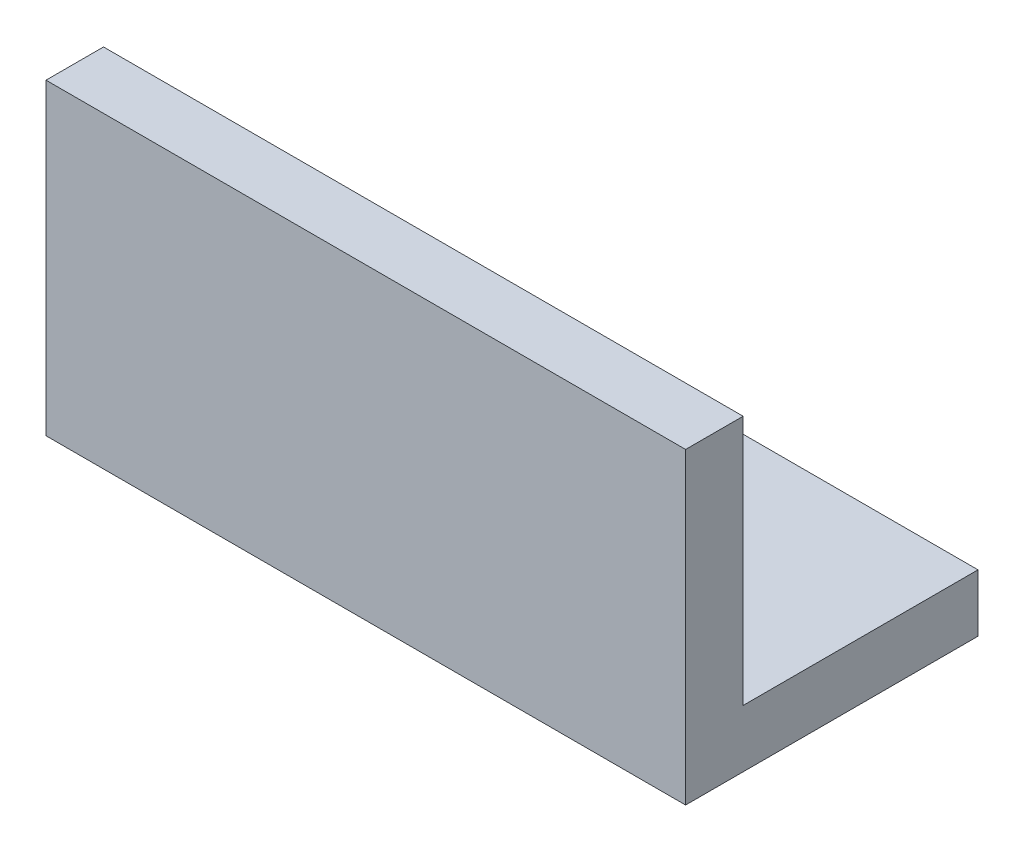
ISO-10303-21;
HEADER;
FILE_DESCRIPTION(('STEP AP214'),'2;1');
FILE_NAME('part.step','',(''),(''),'','','');
FILE_SCHEMA(('AUTOMOTIVE_DESIGN { 1 0 10303 214 1 1 1 1 }'));
ENDSEC;
DATA;
#1=APPLICATION_CONTEXT('core data for automotive mechanical design processes');
#2=APPLICATION_PROTOCOL_DEFINITION('international standard','automotive_design',2000,#1);
#3=PRODUCT_CONTEXT('',#1,'mechanical');
#4=PRODUCT('Part','Part','',(#3));
#5=PRODUCT_RELATED_PRODUCT_CATEGORY('part','',(#4));
#6=PRODUCT_DEFINITION_FORMATION('','',#4);
#7=PRODUCT_DEFINITION_CONTEXT('part definition',#1,'design');
#8=PRODUCT_DEFINITION('design','',#6,#7);
#9=PRODUCT_DEFINITION_SHAPE('','',#8);
#10=(LENGTH_UNIT() NAMED_UNIT(*) SI_UNIT(.MILLI.,.METRE.));
#11=(NAMED_UNIT(*) PLANE_ANGLE_UNIT() SI_UNIT($,.RADIAN.));
#12=(NAMED_UNIT(*) SI_UNIT($,.STERADIAN.) SOLID_ANGLE_UNIT());
#13=UNCERTAINTY_MEASURE_WITH_UNIT(LENGTH_MEASURE(1.E-05),#10,'distance_accuracy_value','');
#14=(GEOMETRIC_REPRESENTATION_CONTEXT(3) GLOBAL_UNCERTAINTY_ASSIGNED_CONTEXT((#13)) GLOBAL_UNIT_ASSIGNED_CONTEXT((#10,
#11,#12)) REPRESENTATION_CONTEXT('',''));
#15=CARTESIAN_POINT('',(0.,0.,0.));
#16=DIRECTION('',(0.,0.,1.));
#17=DIRECTION('',(1.,0.,0.));
#18=AXIS2_PLACEMENT_3D('',#15,#16,#17);
#19=CARTESIAN_POINT('',(0.,34.,0.));
#20=DIRECTION('',(0.,-1.,0.));
#21=DIRECTION('',(0.,0.,-1.));
#22=AXIS2_PLACEMENT_3D('',#19,#20,#21);
#23=PLANE('',#22);
#24=DIRECTION('',(0.,0.,1.));
#25=VECTOR('',#24,1.);
#26=CARTESIAN_POINT('',(73.66,34.,0.));
#27=LINE('',#26,#25);
#28=CARTESIAN_POINT('',(73.66,34.,-6.35));
#29=VERTEX_POINT('',#28);
#30=CARTESIAN_POINT('',(73.66,34.,0.));
#31=VERTEX_POINT('',#30);
#32=EDGE_CURVE('E88',#29,#31,#27,.T.);
#33=ORIENTED_EDGE('',*,*,#32,.F.);
#34=DIRECTION('',(1.,0.,0.));
#35=VECTOR('',#34,1.);
#36=CARTESIAN_POINT('',(76.708,34.,-6.35));
#37=LINE('',#36,#35);
#38=CARTESIAN_POINT('',(3.048,34.,-6.34999999999999));
#39=VERTEX_POINT('',#38);
#40=EDGE_CURVE('E132',#39,#29,#37,.T.);
#41=ORIENTED_EDGE('',*,*,#40,.F.);
#42=DIRECTION('',(0.,0.,-1.));
#43=VECTOR('',#42,1.);
#44=CARTESIAN_POINT('',(3.048,34.,0.));
#45=LINE('',#44,#43);
#46=CARTESIAN_POINT('',(3.048,34.,0.));
#47=VERTEX_POINT('',#46);
#48=EDGE_CURVE('E60',#47,#39,#45,.T.);
#49=ORIENTED_EDGE('',*,*,#48,.F.);
#50=DIRECTION('',(1.,0.,0.));
#51=VECTOR('',#50,1.);
#52=CARTESIAN_POINT('',(0.,34.,0.));
#53=LINE('',#52,#51);
#54=EDGE_CURVE('E102',#47,#31,#53,.T.);
#55=ORIENTED_EDGE('',*,*,#54,.T.);
#56=EDGE_LOOP('',(#33,#41,#49,#55));
#57=FACE_BOUND('',#56,.T.);
#58=ADVANCED_FACE('F38',(#57),#23,.F.);
#59=CARTESIAN_POINT('',(0.,0.,0.));
#60=DIRECTION('',(0.,-1.,0.));
#61=DIRECTION('',(0.,0.,-1.));
#62=AXIS2_PLACEMENT_3D('',#59,#60,#61);
#63=PLANE('',#62);
#64=CARTESIAN_POINT('',(19.177,0.,-16.1399982));
#65=DIRECTION('',(0.,1.,0.));
#66=DIRECTION('',(0.,0.,1.));
#67=AXIS2_PLACEMENT_3D('',#64,#65,#66);
#68=CIRCLE('',#67,3.57187499999999);
#69=CARTESIAN_POINT('',(19.177,0.,-12.5681232));
#70=VERTEX_POINT('',#69);
#71=EDGE_CURVE('E113',#70,#70,#68,.T.);
#72=ORIENTED_EDGE('',*,*,#71,.T.);
#73=EDGE_LOOP('',(#72));
#74=FACE_BOUND('',#73,.T.);
#75=CARTESIAN_POINT('',(57.531,0.,-16.1399982));
#76=DIRECTION('',(0.,1.,0.));
#77=DIRECTION('',(0.,0.,1.));
#78=AXIS2_PLACEMENT_3D('',#75,#76,#77);
#79=CIRCLE('',#78,3.57187499999999);
#80=CARTESIAN_POINT('',(57.531,0.,-12.5681232));
#81=VERTEX_POINT('',#80);
#82=EDGE_CURVE('E123',#81,#81,#79,.T.);
#83=ORIENTED_EDGE('',*,*,#82,.T.);
#84=EDGE_LOOP('',(#83));
#85=FACE_BOUND('',#84,.T.);
#86=DIRECTION('',(-1.,0.,0.));
#87=VECTOR('',#86,1.);
#88=CARTESIAN_POINT('',(0.,0.,-32.2799964));
#89=LINE('',#88,#87);
#90=CARTESIAN_POINT('',(73.66,0.,-32.2799964));
#91=VERTEX_POINT('',#90);
#92=CARTESIAN_POINT('',(3.048,0.,-32.2799964));
#93=VERTEX_POINT('',#92);
#94=EDGE_CURVE('E107',#91,#93,#89,.T.);
#95=ORIENTED_EDGE('',*,*,#94,.F.);
#96=DIRECTION('',(0.,0.,1.));
#97=VECTOR('',#96,1.);
#98=CARTESIAN_POINT('',(73.66,0.,0.));
#99=LINE('',#98,#97);
#100=CARTESIAN_POINT('',(73.66,0.,0.));
#101=VERTEX_POINT('',#100);
#102=EDGE_CURVE('E186',#91,#101,#99,.T.);
#103=ORIENTED_EDGE('',*,*,#102,.T.);
#104=DIRECTION('',(1.,0.,0.));
#105=VECTOR('',#104,1.);
#106=CARTESIAN_POINT('',(0.,0.,0.));
#107=LINE('',#106,#105);
#108=CARTESIAN_POINT('',(3.048,0.,0.));
#109=VERTEX_POINT('',#108);
#110=EDGE_CURVE('E104',#109,#101,#107,.T.);
#111=ORIENTED_EDGE('',*,*,#110,.F.);
#112=DIRECTION('',(0.,0.,-1.));
#113=VECTOR('',#112,1.);
#114=CARTESIAN_POINT('',(3.048,0.,0.));
#115=LINE('',#114,#113);
#116=EDGE_CURVE('E187',#109,#93,#115,.T.);
#117=ORIENTED_EDGE('',*,*,#116,.T.);
#118=EDGE_LOOP('',(#95,#103,#111,#117));
#119=FACE_BOUND('',#118,.T.);
#120=ADVANCED_FACE('F141',(#74,#85,#119),#63,.T.);
#121=CARTESIAN_POINT('',(0.,34.,0.));
#122=DIRECTION('',(0.,0.,-1.));
#123=DIRECTION('',(-1.,0.,0.));
#124=AXIS2_PLACEMENT_3D('',#121,#122,#123);
#125=PLANE('',#124);
#126=DIRECTION('',(0.,-1.,0.));
#127=VECTOR('',#126,1.);
#128=CARTESIAN_POINT('',(73.66,34.,0.));
#129=LINE('',#128,#127);
#130=EDGE_CURVE('E91',#31,#101,#129,.T.);
#131=ORIENTED_EDGE('',*,*,#130,.F.);
#132=ORIENTED_EDGE('',*,*,#54,.F.);
#133=DIRECTION('',(0.,-1.,0.));
#134=VECTOR('',#133,1.);
#135=CARTESIAN_POINT('',(3.048,34.,0.));
#136=LINE('',#135,#134);
#137=EDGE_CURVE('E105',#47,#109,#136,.T.);
#138=ORIENTED_EDGE('',*,*,#137,.T.);
#139=ORIENTED_EDGE('',*,*,#110,.T.);
#140=EDGE_LOOP('',(#131,#132,#138,#139));
#141=FACE_BOUND('',#140,.T.);
#142=ADVANCED_FACE('F40',(#141),#125,.F.);
#143=CARTESIAN_POINT('',(0.,34.,-32.2799964));
#144=DIRECTION('',(0.,0.,1.));
#145=DIRECTION('',(1.,0.,0.));
#146=AXIS2_PLACEMENT_3D('',#143,#144,#145);
#147=PLANE('',#146);
#148=DIRECTION('',(0.,-1.,0.));
#149=VECTOR('',#148,1.);
#150=CARTESIAN_POINT('',(73.66,34.,-32.2799964));
#151=LINE('',#150,#149);
#152=CARTESIAN_POINT('',(73.66,6.35,-32.2799964));
#153=VERTEX_POINT('',#152);
#154=EDGE_CURVE('E178',#153,#91,#151,.T.);
#155=ORIENTED_EDGE('',*,*,#154,.T.);
#156=ORIENTED_EDGE('',*,*,#94,.T.);
#157=DIRECTION('',(0.,-1.,0.));
#158=VECTOR('',#157,1.);
#159=CARTESIAN_POINT('',(3.048,34.,-32.2799964));
#160=LINE('',#159,#158);
#161=CARTESIAN_POINT('',(3.048,6.35,-32.2799964));
#162=VERTEX_POINT('',#161);
#163=EDGE_CURVE('E182',#162,#93,#160,.T.);
#164=ORIENTED_EDGE('',*,*,#163,.F.);
#165=DIRECTION('',(-1.,0.,0.));
#166=VECTOR('',#165,1.);
#167=CARTESIAN_POINT('',(76.708,6.34999999999999,-32.2799964));
#168=LINE('',#167,#166);
#169=EDGE_CURVE('E126',#153,#162,#168,.T.);
#170=ORIENTED_EDGE('',*,*,#169,.F.);
#171=EDGE_LOOP('',(#155,#156,#164,#170));
#172=FACE_BOUND('',#171,.T.);
#173=ADVANCED_FACE('F167',(#172),#147,.F.);
#174=CARTESIAN_POINT('',(0.,6.35,0.));
#175=DIRECTION('',(0.,-1.,0.));
#176=DIRECTION('',(0.,0.,-1.));
#177=AXIS2_PLACEMENT_3D('',#174,#175,#176);
#178=PLANE('',#177);
#179=CARTESIAN_POINT('',(19.177,6.35,-16.1399982));
#180=DIRECTION('',(0.,-1.,0.));
#181=DIRECTION('',(0.,0.,-1.));
#182=AXIS2_PLACEMENT_3D('',#179,#180,#181);
#183=CIRCLE('',#182,3.57187499999999);
#184=CARTESIAN_POINT('',(19.177,6.35,-19.7118732));
#185=VERTEX_POINT('',#184);
#186=EDGE_CURVE('E118',#185,#185,#183,.T.);
#187=ORIENTED_EDGE('',*,*,#186,.T.);
#188=EDGE_LOOP('',(#187));
#189=FACE_BOUND('',#188,.T.);
#190=CARTESIAN_POINT('',(57.531,6.35,-16.1399982));
#191=DIRECTION('',(0.,-1.,0.));
#192=DIRECTION('',(0.,0.,-1.));
#193=AXIS2_PLACEMENT_3D('',#190,#191,#192);
#194=CIRCLE('',#193,3.57187499999999);
#195=CARTESIAN_POINT('',(57.531,6.35,-19.7118732));
#196=VERTEX_POINT('',#195);
#197=EDGE_CURVE('E116',#196,#196,#194,.T.);
#198=ORIENTED_EDGE('',*,*,#197,.T.);
#199=EDGE_LOOP('',(#198));
#200=FACE_BOUND('',#199,.T.);
#201=DIRECTION('',(0.,0.,1.));
#202=VECTOR('',#201,1.);
#203=CARTESIAN_POINT('',(73.66,6.35,0.));
#204=LINE('',#203,#202);
#205=CARTESIAN_POINT('',(73.66,6.34999999999999,-6.35));
#206=VERTEX_POINT('',#205);
#207=EDGE_CURVE('E52',#153,#206,#204,.T.);
#208=ORIENTED_EDGE('',*,*,#207,.F.);
#209=ORIENTED_EDGE('',*,*,#169,.T.);
#210=DIRECTION('',(0.,0.,-1.));
#211=VECTOR('',#210,1.);
#212=CARTESIAN_POINT('',(3.048,6.35,0.));
#213=LINE('',#212,#211);
#214=CARTESIAN_POINT('',(3.048,6.34999999999997,-6.34999999999999));
#215=VERTEX_POINT('',#214);
#216=EDGE_CURVE('E181',#215,#162,#213,.T.);
#217=ORIENTED_EDGE('',*,*,#216,.F.);
#218=DIRECTION('',(1.,0.,0.));
#219=VECTOR('',#218,1.);
#220=CARTESIAN_POINT('',(76.708,6.34999999999999,-6.35));
#221=LINE('',#220,#219);
#222=EDGE_CURVE('E119',#215,#206,#221,.T.);
#223=ORIENTED_EDGE('',*,*,#222,.T.);
#224=EDGE_LOOP('',(#208,#209,#217,#223));
#225=FACE_BOUND('',#224,.T.);
#226=ADVANCED_FACE('F156',(#189,#200,#225),#178,.F.);
#227=CARTESIAN_POINT('',(76.708,-80.9721061681368,-6.35));
#228=DIRECTION('',(0.,0.,1.));
#229=DIRECTION('',(1.,0.,0.));
#230=AXIS2_PLACEMENT_3D('',#227,#228,#229);
#231=PLANE('',#230);
#232=DIRECTION('',(0.,1.,0.));
#233=VECTOR('',#232,1.);
#234=CARTESIAN_POINT('',(73.66,-80.9721061681368,-6.35));
#235=LINE('',#234,#233);
#236=EDGE_CURVE('E13',#206,#29,#235,.T.);
#237=ORIENTED_EDGE('',*,*,#236,.F.);
#238=ORIENTED_EDGE('',*,*,#222,.F.);
#239=DIRECTION('',(0.,-1.,0.));
#240=VECTOR('',#239,1.);
#241=CARTESIAN_POINT('',(3.048,-80.9721061681368,-6.34999999999999));
#242=LINE('',#241,#240);
#243=EDGE_CURVE('E46',#39,#215,#242,.T.);
#244=ORIENTED_EDGE('',*,*,#243,.F.);
#245=ORIENTED_EDGE('',*,*,#40,.T.);
#246=EDGE_LOOP('',(#237,#238,#244,#245));
#247=FACE_BOUND('',#246,.T.);
#248=ADVANCED_FACE('F146',(#247),#231,.F.);
#249=CARTESIAN_POINT('',(19.177,34.,-16.1399982));
#250=DIRECTION('',(0.,-1.,0.));
#251=DIRECTION('',(0.,0.,-1.));
#252=AXIS2_PLACEMENT_3D('',#249,#250,#251);
#253=CYLINDRICAL_SURFACE('',#252,3.57187499999999);
#254=ORIENTED_EDGE('',*,*,#186,.F.);
#255=EDGE_LOOP('',(#254));
#256=FACE_BOUND('',#255,.T.);
#257=ORIENTED_EDGE('',*,*,#71,.F.);
#258=EDGE_LOOP('',(#257));
#259=FACE_BOUND('',#258,.T.);
#260=ADVANCED_FACE('F143',(#256,#259),#253,.F.);
#261=CARTESIAN_POINT('',(57.531,34.,-16.1399982));
#262=DIRECTION('',(0.,-1.,0.));
#263=DIRECTION('',(0.,0.,-1.));
#264=AXIS2_PLACEMENT_3D('',#261,#262,#263);
#265=CYLINDRICAL_SURFACE('',#264,3.57187499999999);
#266=ORIENTED_EDGE('',*,*,#197,.F.);
#267=EDGE_LOOP('',(#266));
#268=FACE_BOUND('',#267,.T.);
#269=ORIENTED_EDGE('',*,*,#82,.F.);
#270=EDGE_LOOP('',(#269));
#271=FACE_BOUND('',#270,.T.);
#272=ADVANCED_FACE('F145',(#268,#271),#265,.F.);
#273=CARTESIAN_POINT('',(3.048,34.,0.));
#274=DIRECTION('',(-1.,0.,0.));
#275=DIRECTION('',(0.,0.,1.));
#276=AXIS2_PLACEMENT_3D('',#273,#274,#275);
#277=PLANE('',#276);
#278=ORIENTED_EDGE('',*,*,#137,.F.);
#279=ORIENTED_EDGE('',*,*,#48,.T.);
#280=ORIENTED_EDGE('',*,*,#243,.T.);
#281=ORIENTED_EDGE('',*,*,#216,.T.);
#282=ORIENTED_EDGE('',*,*,#163,.T.);
#283=ORIENTED_EDGE('',*,*,#116,.F.);
#284=EDGE_LOOP('',(#278,#279,#280,#281,#282,#283));
#285=FACE_BOUND('',#284,.T.);
#286=ADVANCED_FACE('F152',(#285),#277,.T.);
#287=CARTESIAN_POINT('',(73.66,34.,0.));
#288=DIRECTION('',(1.,0.,0.));
#289=DIRECTION('',(0.,0.,-1.));
#290=AXIS2_PLACEMENT_3D('',#287,#288,#289);
#291=PLANE('',#290);
#292=ORIENTED_EDGE('',*,*,#154,.F.);
#293=ORIENTED_EDGE('',*,*,#207,.T.);
#294=ORIENTED_EDGE('',*,*,#236,.T.);
#295=ORIENTED_EDGE('',*,*,#32,.T.);
#296=ORIENTED_EDGE('',*,*,#130,.T.);
#297=ORIENTED_EDGE('',*,*,#102,.F.);
#298=EDGE_LOOP('',(#292,#293,#294,#295,#296,#297));
#299=FACE_BOUND('',#298,.T.);
#300=ADVANCED_FACE('F90',(#299),#291,.T.);
#301=CLOSED_SHELL('',(#58,#120,#142,#173,#226,#248,#260,#272,#286,#300));
#302=MANIFOLD_SOLID_BREP('B2',#301);
#303=ADVANCED_BREP_SHAPE_REPRESENTATION('',(#18,#302),#14);
#304=SHAPE_DEFINITION_REPRESENTATION(#9,#303);
ENDSEC;
END-ISO-10303-21;
